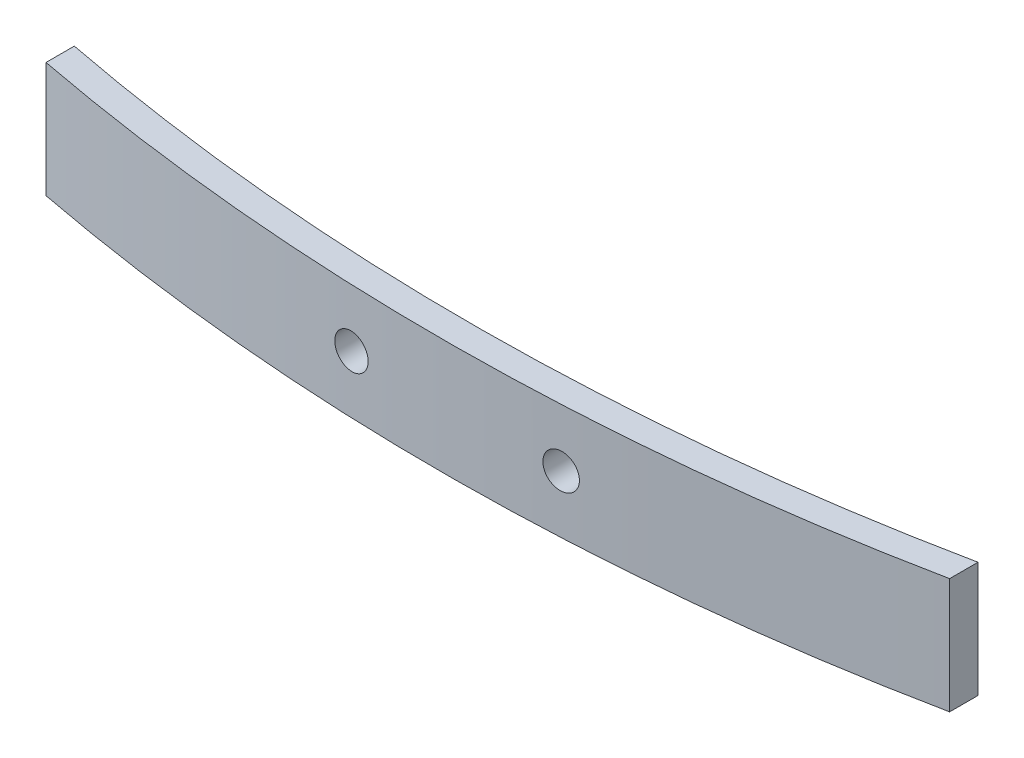
ISO-10303-21;
HEADER;
FILE_DESCRIPTION(('STEP AP214'),'2;1');
FILE_NAME('part.step','',(''),(''),'','','');
FILE_SCHEMA(('AUTOMOTIVE_DESIGN { 1 0 10303 214 1 1 1 1 }'));
ENDSEC;
DATA;
#1=APPLICATION_CONTEXT('core data for automotive mechanical design processes');
#2=APPLICATION_PROTOCOL_DEFINITION('international standard','automotive_design',2000,#1);
#3=PRODUCT_CONTEXT('',#1,'mechanical');
#4=PRODUCT('Part','Part','',(#3));
#5=PRODUCT_RELATED_PRODUCT_CATEGORY('part','',(#4));
#6=PRODUCT_DEFINITION_FORMATION('','',#4);
#7=PRODUCT_DEFINITION_CONTEXT('part definition',#1,'design');
#8=PRODUCT_DEFINITION('design','',#6,#7);
#9=PRODUCT_DEFINITION_SHAPE('','',#8);
#10=(LENGTH_UNIT() NAMED_UNIT(*) SI_UNIT(.MILLI.,.METRE.));
#11=(NAMED_UNIT(*) PLANE_ANGLE_UNIT() SI_UNIT($,.RADIAN.));
#12=(NAMED_UNIT(*) SI_UNIT($,.STERADIAN.) SOLID_ANGLE_UNIT());
#13=UNCERTAINTY_MEASURE_WITH_UNIT(LENGTH_MEASURE(1.E-05),#10,'distance_accuracy_value','');
#14=(GEOMETRIC_REPRESENTATION_CONTEXT(3) GLOBAL_UNCERTAINTY_ASSIGNED_CONTEXT((#13)) GLOBAL_UNIT_ASSIGNED_CONTEXT((#10,
#11,#12)) REPRESENTATION_CONTEXT('',''));
#15=CARTESIAN_POINT('',(0.,0.,0.));
#16=DIRECTION('',(0.,0.,1.));
#17=DIRECTION('',(1.,0.,0.));
#18=AXIS2_PLACEMENT_3D('',#15,#16,#17);
#19=CARTESIAN_POINT('',(-0.864955357142889,8.3,-164.510629845203));
#20=DIRECTION('',(0.,-1.,0.));
#21=DIRECTION('',(0.,0.,-1.));
#22=AXIS2_PLACEMENT_3D('',#19,#20,#21);
#23=CYLINDRICAL_SURFACE('',#22,165.210703971618);
#24=CARTESIAN_POINT('',(8.75496027693128,4.15,0.419761320254231));
#25=CARTESIAN_POINT('',(8.75495715259004,4.22012776188887,0.419761542884701));
#26=CARTESIAN_POINT('',(8.74903882101776,4.29030639664117,0.42010703230094));
#27=CARTESIAN_POINT('',(8.72551339839696,4.4287291306684,0.421476638973455));
#28=CARTESIAN_POINT('',(8.70789224050293,4.49697079864165,0.422501572922137));
#29=CARTESIAN_POINT('',(8.66146861973836,4.62949241544458,0.425189461827747));
#30=CARTESIAN_POINT('',(8.63267193494553,4.69377439168322,0.426852087074241));
#31=CARTESIAN_POINT('',(8.56472769460717,4.81657072161569,0.430750458858259));
#32=CARTESIAN_POINT('',(8.52558266973037,4.87508648063179,0.432986065270157));
#33=CARTESIAN_POINT('',(8.43801342814094,4.9847698821034,0.437948195991448));
#34=CARTESIAN_POINT('',(8.38958075080873,5.0359307496672,0.440675167774048));
#35=CARTESIAN_POINT('',(8.28483422347771,5.1293998710016,0.44651853933903));
#36=CARTESIAN_POINT('',(8.22852000329769,5.17170770872906,0.449634957412234));
#37=CARTESIAN_POINT('',(8.10951615566661,5.24633595250762,0.456152020027471));
#38=CARTESIAN_POINT('',(8.0468168572877,5.27864089983541,0.459553094283174));
#39=CARTESIAN_POINT('',(7.91689297455711,5.33226498600396,0.466520314337743));
#40=CARTESIAN_POINT('',(7.84966836586007,5.35358406573732,0.470086461024638));
#41=CARTESIAN_POINT('',(7.71251624830171,5.38465390754756,0.477273972274191));
#42=CARTESIAN_POINT('',(7.64258565741253,5.3943910522926,0.480895396774689));
#43=CARTESIAN_POINT('',(7.50207969231472,5.40197507469827,0.488080389340085));
#44=CARTESIAN_POINT('',(7.43150431760442,5.39982194310727,0.491643957359964));
#45=CARTESIAN_POINT('',(7.29169229198259,5.38368150567758,0.498614464223544));
#46=CARTESIAN_POINT('',(7.22245601084655,5.36969097748398,0.502021360151969));
#47=CARTESIAN_POINT('',(7.08731041847516,5.33026406415503,0.508589507906716));
#48=CARTESIAN_POINT('',(7.02140110324483,5.30482769276403,0.511750760028005));
#49=CARTESIAN_POINT('',(6.89482389528012,5.24324482251413,0.517751197591634));
#50=CARTESIAN_POINT('',(6.83415294085498,5.20710463525015,0.520590571471681));
#51=CARTESIAN_POINT('',(6.71973857092649,5.12513044677585,0.525888568664156));
#52=CARTESIAN_POINT('',(6.66599511710652,5.07929649918628,0.528347194082553));
#53=CARTESIAN_POINT('',(6.56702167323868,4.97928617455705,0.532833768859453));
#54=CARTESIAN_POINT('',(6.52178297040707,4.92511843978125,0.534862159253174));
#55=CARTESIAN_POINT('',(6.44104226200566,4.80994279406873,0.538456017950514));
#56=CARTESIAN_POINT('',(6.40554020414914,4.7489349198667,0.54002148874006));
#57=CARTESIAN_POINT('',(6.34531813797664,4.62187688825208,0.542663290949959));
#58=CARTESIAN_POINT('',(6.32058734079934,4.5558318545333,0.543740111864182));
#59=CARTESIAN_POINT('',(6.28256238689218,4.42052174403214,0.545391136221003));
#60=CARTESIAN_POINT('',(6.26926818249207,4.35125668067283,0.545965341758613));
#61=CARTESIAN_POINT('',(6.25450125084769,4.21152194868698,0.546602956663125));
#62=CARTESIAN_POINT('',(6.25302069467492,4.1410531088456,0.546666704311598));
#63=CARTESIAN_POINT('',(6.26190269709429,4.00086728732697,0.546283430440176));
#64=CARTESIAN_POINT('',(6.27226523401256,3.93115030427399,0.545836409855029));
#65=CARTESIAN_POINT('',(6.30453459144254,3.7944600012262,0.54443787079372));
#66=CARTESIAN_POINT('',(6.32643933451396,3.72748618983486,0.543486443103795));
#67=CARTESIAN_POINT('',(6.38116693951449,3.59816841100119,0.541092849093423));
#68=CARTESIAN_POINT('',(6.41398980811933,3.53582444638974,0.539650682472919));
#69=CARTESIAN_POINT('',(6.48963086187634,3.41751271541944,0.536297410542902));
#70=CARTESIAN_POINT('',(6.53245236046259,3.36154707193376,0.534386149770075));
#71=CARTESIAN_POINT('',(6.62686526857058,3.25759933104675,0.530127416616021));
#72=CARTESIAN_POINT('',(6.67845671174829,3.20961726428495,0.527779942560759));
#73=CARTESIAN_POINT('',(6.78898637350203,3.12295719408791,0.522690850990611));
#74=CARTESIAN_POINT('',(6.84793034066777,3.08428654090255,0.519948924812313));
#75=CARTESIAN_POINT('',(6.97145790954368,3.01738845265188,0.514129364496978));
#76=CARTESIAN_POINT('',(7.03604153672885,2.98916106476303,0.511051728843487));
#77=CARTESIAN_POINT('',(7.16908698444315,2.94391904019975,0.50462795534726));
#78=CARTESIAN_POINT('',(7.23755281675207,2.92691624080627,0.501281538208516));
#79=CARTESIAN_POINT('',(7.37635861492918,2.90464766013211,0.494407282898964));
#80=CARTESIAN_POINT('',(7.44669859549448,2.89938197092164,0.490879443305233));
#81=CARTESIAN_POINT('',(7.58732689699678,2.90073424051436,0.483735492092817));
#82=CARTESIAN_POINT('',(7.65761510543844,2.90736348948183,0.480119299827385));
#83=CARTESIAN_POINT('',(7.79607956813265,2.93233885968863,0.472908694526101));
#84=CARTESIAN_POINT('',(7.86425581074991,2.95068504546716,0.469314281610324));
#85=CARTESIAN_POINT('',(7.99658775089416,2.99858527301703,0.462259310556309));
#86=CARTESIAN_POINT('',(8.0607418890637,3.02814363078217,0.458798804529963));
#87=CARTESIAN_POINT('',(8.18317480890034,3.09763156107121,0.452129015386681));
#88=CARTESIAN_POINT('',(8.24145382984545,3.13756071098308,0.448919722039708));
#89=CARTESIAN_POINT('',(8.35044266706128,3.22663141697335,0.442867022064361));
#90=CARTESIAN_POINT('',(8.40115749080369,3.27576682948656,0.44002337355392));
#91=CARTESIAN_POINT('',(8.4936283502276,3.38189250881125,0.434802856160991));
#92=CARTESIAN_POINT('',(8.53538221583379,3.43888467281662,0.432426100357688));
#93=CARTESIAN_POINT('',(8.6086851855516,3.55903344302298,0.428232139382776));
#94=CARTESIAN_POINT('',(8.64024332695314,3.62218452507149,0.426414438744662));
#95=CARTESIAN_POINT('',(8.69227167185321,3.75285327847664,0.423407891004748));
#96=CARTESIAN_POINT('',(8.71275530328993,3.82036555010171,0.422218282377225));
#97=CARTESIAN_POINT('',(8.7365727105935,3.93192651802067,0.420833020846883));
#98=CARTESIAN_POINT('',(8.74345935750805,3.97524632551218,0.420431798844835));
#99=CARTESIAN_POINT('',(8.75265411467353,4.0623707998554,0.419895879115414));
#100=CARTESIAN_POINT('',(8.75496222940765,4.1061754662323,0.419761181127067));
#101=CARTESIAN_POINT('',(8.75496027693128,4.15,0.419761320254231));
#102=B_SPLINE_CURVE_WITH_KNOTS('',3,(#24,#25,#26,#27,#28,#29,#30,#31,#32,#33,#34,#35,#36,#37,
#38,#39,#40,#41,#42,#43,#44,#45,#46,#47,#48,#49,#50,#51,#52,#53,#54,#55,#56,#57,#58,#59,#60,#61,
#62,#63,#64,#65,#66,#67,#68,#69,#70,#71,#72,#73,#74,#75,#76,#77,#78,#79,#80,#81,#82,#83,#84,#85,
#86,#87,#88,#89,#90,#91,#92,#93,#94,#95,#96,#97,#98,#99,#100,#101),.UNSPECIFIED.,.T.,.F.,(4,2,2,
2,2,2,2,2,2,2,2,2,2,2,2,2,2,2,2,2,2,2,2,2,2,2,2,2,2,2,2,2,2,2,2,2,2,2,4),(0.,0.210223177189666,
0.420699501951169,0.631067148901838,0.841383398320761,1.05189215408555,1.26241080036969,
1.47325318222957,1.6840966984751,1.89518786738256,2.10627920053656,2.31742801508991,
2.52857657609271,2.73960087861519,2.95062401389348,3.16142977192405,3.37223439788553,
3.58282738642935,3.79341949717081,4.00387203649564,4.21432419067519,4.42473847925807,
4.63515289649597,4.84563714192886,5.05612219514426,5.26677286045359,5.47742447734574,
5.6882978908643,5.8991729585455,6.11024828566987,6.3213247754489,6.53248259923149,
6.7436318196366,6.95464063361698,7.16570049008606,7.37657275067938,7.58718875014188,
7.718562424425,7.84993597007017),.UNSPECIFIED.);
#103=CARTESIAN_POINT('',(8.75496027693128,4.15,0.419761320254231));
#104=VERTEX_POINT('',#103);
#105=EDGE_CURVE('E112',#104,#104,#102,.T.);
#106=ORIENTED_EDGE('',*,*,#105,.T.);
#107=EDGE_LOOP('',(#106));
#108=FACE_BOUND('',#107,.T.);
#109=CARTESIAN_POINT('',(-6.24503972306872,4.15,0.612449701579171));
#110=CARTESIAN_POINT('',(-6.24504283877439,4.22018360507798,0.612449640448258));
#111=CARTESIAN_POINT('',(-6.2509704916655,4.29041808412336,0.612256794117345));
#112=CARTESIAN_POINT('',(-6.27453424552286,4.42895230581188,0.61148647073164));
#113=CARTESIAN_POINT('',(-6.2921844319995,4.49724961773537,0.610908530955234));
#114=CARTESIAN_POINT('',(-6.33868895925644,4.62988204890237,0.609373441567636));
#115=CARTESIAN_POINT('',(-6.36753784796296,4.69421907857243,0.60841647647983));
#116=CARTESIAN_POINT('',(-6.43561123976186,4.81711721137688,0.606133852436909));
#117=CARTESIAN_POINT('',(-6.47483317008242,4.87567974179275,0.604808284900166));
#118=CARTESIAN_POINT('',(-6.5625536422637,4.98540689200779,0.601804578598962));
#119=CARTESIAN_POINT('',(-6.611055011315,5.03656924881329,0.600126332367601));
#120=CARTESIAN_POINT('',(-6.71594967952864,5.13002721489337,0.596442445789051));
#121=CARTESIAN_POINT('',(-6.77234330523671,5.17232245710605,0.594436791894649));
#122=CARTESIAN_POINT('',(-6.89144872175326,5.24686646391694,0.59013221246902));
#123=CARTESIAN_POINT('',(-6.9541636281333,5.27911024208824,0.5878331421715));
#124=CARTESIAN_POINT('',(-7.08410720631077,5.33261213888801,0.582989292877448));
#125=CARTESIAN_POINT('',(-7.15133588543513,5.3538702396836,0.580444513482067));
#126=CARTESIAN_POINT('',(-7.28844540689511,5.38481217998928,0.575166604891806));
#127=CARTESIAN_POINT('',(-7.35832796307873,5.39448840424185,0.572433353020987));
#128=CARTESIAN_POINT('',(-7.49872098348199,5.40196966393845,0.566851342210558));
#129=CARTESIAN_POINT('',(-7.56923144889067,5.39977467689789,0.564002583052183));
#130=CARTESIAN_POINT('',(-7.70892020746554,5.38357274204756,0.558270140200238));
#131=CARTESIAN_POINT('',(-7.77809774336756,5.36955927118439,0.555386438086882));
#132=CARTESIAN_POINT('',(-7.91311781585716,5.33010907067557,0.549676351579997));
#133=CARTESIAN_POINT('',(-7.97896034307322,5.30467230893204,0.546849967347547));
#134=CARTESIAN_POINT('',(-8.10544890364487,5.24309153267341,0.541349763017055));
#135=CARTESIAN_POINT('',(-8.1660943101938,5.20694622897485,0.538675961334419));
#136=CARTESIAN_POINT('',(-8.28045560269151,5.12497251435407,0.533577398562491));
#137=CARTESIAN_POINT('',(-8.33417150490061,5.0791441261542,0.53115263688882));
#138=CARTESIAN_POINT('',(-8.43311865371031,4.97912834555304,0.52664494025073));
#139=CARTESIAN_POINT('',(-8.47835422530451,4.92494523992106,0.52456183111072));
#140=CARTESIAN_POINT('',(-8.55908455655416,4.80973930743974,0.520817828259599));
#141=CARTESIAN_POINT('',(-8.59457936685342,4.74871651615337,0.519156932353336));
#142=CARTESIAN_POINT('',(-8.65478398333838,4.62162746856163,0.516326100462941));
#143=CARTESIAN_POINT('',(-8.67950435821031,4.55556622958673,0.515155683409783));
#144=CARTESIAN_POINT('',(-8.7175040630106,4.4202243510701,0.513351898694548));
#145=CARTESIAN_POINT('',(-8.73078346025493,4.35094373047297,0.512718527872618));
#146=CARTESIAN_POINT('',(-8.74551430103045,4.21119839428657,0.512015731282366));
#147=CARTESIAN_POINT('',(-8.74697666898013,4.14073483269903,0.511945784648838));
#148=CARTESIAN_POINT('',(-8.73806040240198,4.00056277842912,0.512371408910377));
#149=CARTESIAN_POINT('',(-8.72768179925441,3.93085428374621,0.512866978306745));
#150=CARTESIAN_POINT('',(-8.69538512842358,3.79419187891503,0.51440260426172));
#151=CARTESIAN_POINT('',(-8.67347043688291,3.72723716902388,0.515442501517261));
#152=CARTESIAN_POINT('',(-8.61872902277598,3.59795852069422,0.518023567611638));
#153=CARTESIAN_POINT('',(-8.58590227867445,3.53563459139498,0.51956473743975));
#154=CARTESIAN_POINT('',(-8.51025151058069,3.41734986948092,0.523086657485392));
#155=CARTESIAN_POINT('',(-8.46742220765421,3.36139246012191,0.525067639790299));
#156=CARTESIAN_POINT('',(-8.37299376296533,3.25746068544556,0.529390434822085));
#157=CARTESIAN_POINT('',(-8.32139457053689,3.2094863662519,0.531732249633585));
#158=CARTESIAN_POINT('',(-8.21083440462293,3.12283102847463,0.53669011816241));
#159=CARTESIAN_POINT('',(-8.15186605470748,3.08415943686989,0.539306446236985));
#160=CARTESIAN_POINT('',(-8.02828172033344,3.01726434827163,0.544716275013323));
#161=CARTESIAN_POINT('',(-7.96366571211947,2.98904089522806,0.547509776460306));
#162=CARTESIAN_POINT('',(-7.83055792972229,2.94381903365589,0.553180619859146));
#163=CARTESIAN_POINT('',(-7.76206278674184,2.92683054948449,0.55605803359858));
#164=CARTESIAN_POINT('',(-7.62319148762382,2.90459965098885,0.561802071644821));
#165=CARTESIAN_POINT('',(-7.5528153234997,2.89935728654505,0.564668695905759));
#166=CARTESIAN_POINT('',(-7.41215603053966,2.90076879979632,0.570307352243302));
#167=CARTESIAN_POINT('',(-7.34187293828336,2.90742645045739,0.573079354035342));
#168=CARTESIAN_POINT('',(-7.20341837634375,2.93245901601626,0.578453364712801));
#169=CARTESIAN_POINT('',(-7.13524690890161,2.95083394334973,0.581055373417801));
#170=CARTESIAN_POINT('',(-7.00297137414322,2.99877618278969,0.586026236209309));
#171=CARTESIAN_POINT('',(-6.93886624220364,3.02834055110486,0.588395151413221));
#172=CARTESIAN_POINT('',(-6.81653024260381,3.09782459200736,0.59285047753035));
#173=CARTESIAN_POINT('',(-6.75829912700231,3.13774382726325,0.594936900368796));
#174=CARTESIAN_POINT('',(-6.64940632986686,3.22677365919108,0.598787831696479));
#175=CARTESIAN_POINT('',(-6.59873922526678,3.27587761335997,0.600552571021358));
#176=CARTESIAN_POINT('',(-6.50635532558204,3.38191900568697,0.603734933028591));
#177=CARTESIAN_POINT('',(-6.46464072829734,3.43885836178299,0.605152470486499));
#178=CARTESIAN_POINT('',(-6.39137389484262,3.55892532336698,0.607620971669095));
#179=CARTESIAN_POINT('',(-6.35982009157116,3.62205197262659,0.608671991923887));
#180=CARTESIAN_POINT('',(-6.3077939874283,3.75266178054924,0.610395159078546));
#181=CARTESIAN_POINT('',(-6.28730836815957,3.82013959344892,0.611067761370984));
#182=CARTESIAN_POINT('',(-6.26346456763099,3.93170688176151,0.611848584729489));
#183=CARTESIAN_POINT('',(-6.25656390265825,3.97507040496065,0.612073880533101));
#184=CARTESIAN_POINT('',(-6.24735050720567,4.06228266014171,0.612374458044323));
#185=CARTESIAN_POINT('',(-6.24503777558155,4.10613139200262,0.612449739789349));
#186=CARTESIAN_POINT('',(-6.24503972306872,4.15,0.612449701579171));
#187=B_SPLINE_CURVE_WITH_KNOTS('',3,(#109,#110,#111,#112,#113,#114,#115,#116,#117,#118,#119,
#120,#121,#122,#123,#124,#125,#126,#127,#128,#129,#130,#131,#132,#133,#134,#135,#136,#137,#138,
#139,#140,#141,#142,#143,#144,#145,#146,#147,#148,#149,#150,#151,#152,#153,#154,#155,#156,#157,
#158,#159,#160,#161,#162,#163,#164,#165,#166,#167,#168,#169,#170,#171,#172,#173,#174,#175,#176,
#177,#178,#179,#180,#181,#182,#183,#184,#185,#186),.UNSPECIFIED.,.T.,.F.,(4,2,2,2,2,2,2,2,2,2,2,
2,2,2,2,2,2,2,2,2,2,2,2,2,2,2,2,2,2,2,2,2,2,2,2,2,2,2,4),(0.,0.210390661059293,
0.421034580871365,0.631576077319847,0.842065403143359,1.05261896171306,1.26318123460973,
1.47384779963844,1.68451470663738,1.89532005432909,2.10612580129541,2.31704797586549,
2.52797074310193,2.73891891330345,2.9498665884991,3.16070638532802,3.37154508594557,
3.58217650604036,3.7928066868217,4.00324212527539,4.21367700604665,4.42405033532167,
4.63442407977717,4.84490910264051,5.0553953415746,5.26609398795101,5.47679352061828,
5.68767892600816,5.89856522693079,6.10951840238898,6.32047180173413,6.53136974061397,
6.74225877379887,6.95299587501928,7.16378465221264,7.37454090381962,7.58504298341746,
7.716548735053,7.84805445388952),.UNSPECIFIED.);
#188=CARTESIAN_POINT('',(-6.24503972306872,4.15,0.612449701579171));
#189=VERTEX_POINT('',#188);
#190=EDGE_CURVE('E123',#189,#189,#187,.T.);
#191=ORIENTED_EDGE('',*,*,#190,.T.);
#192=EDGE_LOOP('',(#191));
#193=FACE_BOUND('',#192,.T.);
#194=CARTESIAN_POINT('',(-0.864955357142889,0.,-164.510629845203));
#195=DIRECTION('',(0.,-1.,0.));
#196=DIRECTION('',(0.,0.,1.));
#197=AXIS2_PLACEMENT_3D('',#194,#195,#196);
#198=CIRCLE('',#197,165.210703971618);
#199=CARTESIAN_POINT('',(32.3290587197964,0.,-2.66893516717083));
#200=VERTEX_POINT('',#199);
#201=CARTESIAN_POINT('',(-32.3092176120712,0.,-2.31989312438794));
#202=VERTEX_POINT('',#201);
#203=EDGE_CURVE('E109',#200,#202,#198,.T.);
#204=ORIENTED_EDGE('',*,*,#203,.T.);
#205=DIRECTION('',(0.,-1.,0.));
#206=VECTOR('',#205,1.);
#207=CARTESIAN_POINT('',(-32.3092176120712,8.3,-2.31989312438794));
#208=LINE('',#207,#206);
#209=CARTESIAN_POINT('',(-32.3092176120712,8.3,-2.31989312438794));
#210=VERTEX_POINT('',#209);
#211=EDGE_CURVE('E11',#210,#202,#208,.T.);
#212=ORIENTED_EDGE('',*,*,#211,.F.);
#213=CARTESIAN_POINT('',(-0.864955357142889,8.3,-164.510629845203));
#214=DIRECTION('',(0.,-1.,0.));
#215=DIRECTION('',(0.,0.,1.));
#216=AXIS2_PLACEMENT_3D('',#213,#214,#215);
#217=CIRCLE('',#216,165.210703971618);
#218=CARTESIAN_POINT('',(32.3290587197964,8.3,-2.66893516717083));
#219=VERTEX_POINT('',#218);
#220=EDGE_CURVE('E96',#219,#210,#217,.T.);
#221=ORIENTED_EDGE('',*,*,#220,.F.);
#222=DIRECTION('',(0.,-1.,0.));
#223=VECTOR('',#222,1.);
#224=CARTESIAN_POINT('',(32.3290587197964,8.3,-2.66893516717083));
#225=LINE('',#224,#223);
#226=EDGE_CURVE('E105',#219,#200,#225,.T.);
#227=ORIENTED_EDGE('',*,*,#226,.T.);
#228=EDGE_LOOP('',(#204,#212,#221,#227));
#229=FACE_BOUND('',#228,.T.);
#230=ADVANCED_FACE('F37',(#108,#193,#229),#23,.F.);
#231=CARTESIAN_POINT('',(-32.3092176120712,8.3,-2.31989312438794));
#232=DIRECTION('',(1.,0.,0.));
#233=DIRECTION('',(0.,0.,-1.));
#234=AXIS2_PLACEMENT_3D('',#231,#232,#233);
#235=PLANE('',#234);
#236=DIRECTION('',(0.,0.,1.));
#237=VECTOR('',#236,1.);
#238=CARTESIAN_POINT('',(-32.3092176120712,0.,-2.31989312438794));
#239=LINE('',#238,#237);
#240=CARTESIAN_POINT('',(-32.3092176120713,0.,-0.283111158695365));
#241=VERTEX_POINT('',#240);
#242=EDGE_CURVE('E100',#202,#241,#239,.T.);
#243=ORIENTED_EDGE('',*,*,#242,.T.);
#244=DIRECTION('',(0.,-1.,0.));
#245=VECTOR('',#244,1.);
#246=CARTESIAN_POINT('',(-32.3092176120713,8.3,-0.283111158695365));
#247=LINE('',#246,#245);
#248=CARTESIAN_POINT('',(-32.3092176120713,8.3,-0.283111158695365));
#249=VERTEX_POINT('',#248);
#250=EDGE_CURVE('E52',#249,#241,#247,.T.);
#251=ORIENTED_EDGE('',*,*,#250,.F.);
#252=DIRECTION('',(0.,0.,1.));
#253=VECTOR('',#252,1.);
#254=CARTESIAN_POINT('',(-32.3092176120712,8.3,-2.31989312438794));
#255=LINE('',#254,#253);
#256=EDGE_CURVE('E91',#210,#249,#255,.T.);
#257=ORIENTED_EDGE('',*,*,#256,.F.);
#258=ORIENTED_EDGE('',*,*,#211,.T.);
#259=EDGE_LOOP('',(#243,#251,#257,#258));
#260=FACE_BOUND('',#259,.T.);
#261=ADVANCED_FACE('F99',(#260),#235,.F.);
#262=CARTESIAN_POINT('',(-0.864955357142889,8.3,-164.510629845203));
#263=DIRECTION('',(0.,-1.,0.));
#264=DIRECTION('',(0.,0.,-1.));
#265=AXIS2_PLACEMENT_3D('',#262,#263,#264);
#266=CYLINDRICAL_SURFACE('',#265,167.210703971618);
#267=CARTESIAN_POINT('',(8.75496027693128,4.15,2.42311972592843));
#268=CARTESIAN_POINT('',(8.7549571528464,4.0798702088655,2.42311994587401));
#269=CARTESIAN_POINT('',(8.74903848237771,4.00968954399093,2.42346130863886));
#270=CARTESIAN_POINT('',(8.72551166864732,3.8712627632816,2.42481455884801));
#271=CARTESIAN_POINT('',(8.70788945763707,3.80301907877586,2.42582725323555));
#272=CARTESIAN_POINT('',(8.66146290914616,3.67049345987212,2.42848305287518));
#273=CARTESIAN_POINT('',(8.63266433975993,3.6062095016657,2.43012583293631));
#274=CARTESIAN_POINT('',(8.5647154284122,3.48340948989038,2.43397768644527));
#275=CARTESIAN_POINT('',(8.52556761836319,3.42489203036412,2.43618662138089));
#276=CARTESIAN_POINT('',(8.43799273186777,3.31520683510581,2.44108951951476));
#277=CARTESIAN_POINT('',(8.38955737216025,3.26404573208298,2.44378391554936));
#278=CARTESIAN_POINT('',(8.28480494382434,3.17057665988944,2.4495574898447));
#279=CARTESIAN_POINT('',(8.22848750642859,3.12826910516807,2.45263668610781));
#280=CARTESIAN_POINT('',(8.10947904666495,3.05364358907666,2.45907579272007));
#281=CARTESIAN_POINT('',(8.04677858600776,3.02134071483143,2.46243611741457));
#282=CARTESIAN_POINT('',(7.91685254726984,2.96772091932823,2.469319851007));
#283=CARTESIAN_POINT('',(7.8496269456401,2.94640405524691,2.47284326075362));
#284=CARTESIAN_POINT('',(7.71247508035552,2.91533926667632,2.47994452278065));
#285=CARTESIAN_POINT('',(7.64254580844858,2.9056046354044,2.48352243285368));
#286=CARTESIAN_POINT('',(7.50204294969634,2.89802510464708,2.49062107608184));
#287=CARTESIAN_POINT('',(7.43146936238961,2.90018021367689,2.49414180919603));
#288=CARTESIAN_POINT('',(7.29166180538937,2.91632389376349,2.50102849084591));
#289=CARTESIAN_POINT('',(7.22242819670582,2.93031560960369,2.5043943979964));
#290=CARTESIAN_POINT('',(7.08728821765012,2.96974394050637,2.51088351236731));
#291=CARTESIAN_POINT('',(7.02138184346096,2.99518054243892,2.51400671986617));
#292=CARTESIAN_POINT('',(6.89480967024032,3.05676323309922,2.51993497986177));
#293=CARTESIAN_POINT('',(6.83414088213581,3.09290316059229,2.52274021411475));
#294=CARTESIAN_POINT('',(6.71973079534213,3.1748759681489,2.5279745059938));
#295=CARTESIAN_POINT('',(6.66598945918457,3.22070879578306,2.5304035656545));
#296=CARTESIAN_POINT('',(6.56701870175015,3.32071724989849,2.53483624587924));
#297=CARTESIAN_POINT('',(6.52178077537898,3.37488444065654,2.53684029180138));
#298=CARTESIAN_POINT('',(6.44104150253602,3.49005854005354,2.54039101701982));
#299=CARTESIAN_POINT('',(6.40554010505716,3.55106541285887,2.54193769871214));
#300=CARTESIAN_POINT('',(6.34531832849511,3.67812258625027,2.54454783031626));
#301=CARTESIAN_POINT('',(6.32058741768736,3.74416788548266,2.5456117523287));
#302=CARTESIAN_POINT('',(6.28256233948997,3.87947841102811,2.54724299762261));
#303=CARTESIAN_POINT('',(6.26926812555421,3.94874362423525,2.54781032292518));
#304=CARTESIAN_POINT('',(6.25450110051763,4.08847970756632,2.54844030136632));
#305=CARTESIAN_POINT('',(6.25302064684505,4.15894976866929,2.54850328077702));
#306=CARTESIAN_POINT('',(6.26190326247084,4.29913800347308,2.54812457345232));
#307=CARTESIAN_POINT('',(6.27226631062292,4.36885617851615,2.54768288761797));
#308=CARTESIAN_POINT('',(6.30453719521118,4.50554910587772,2.54630104153986));
#309=CARTESIAN_POINT('',(6.32644300362672,4.57252433789419,2.54536096886065));
#310=CARTESIAN_POINT('',(6.38117331705684,4.70184480051592,2.54299593962249));
#311=CARTESIAN_POINT('',(6.4139978285545,4.76419002837205,2.54157098277563));
#312=CARTESIAN_POINT('',(6.48964248692514,4.8825035365914,2.53825773419188));
#313=CARTESIAN_POINT('',(6.53246586861391,4.93846974448754,2.5363692924991));
#314=CARTESIAN_POINT('',(6.62688304206684,5.04241829266776,2.53216140069847));
#315=CARTESIAN_POINT('',(6.6784768667747,5.09040060296125,2.52984194897164));
#316=CARTESIAN_POINT('',(6.78901074100218,5.1770598438358,2.52481364780539));
#317=CARTESIAN_POINT('',(6.84795640280315,5.21572959853617,2.52210450063349));
#318=CARTESIAN_POINT('',(6.97148756497417,5.28262558158907,2.51635451163316));
#319=CARTESIAN_POINT('',(7.0360730900755,5.31085176414284,2.51331366835021));
#320=CARTESIAN_POINT('',(7.16912077651875,5.3560903483621,2.50696677170296));
#321=CARTESIAN_POINT('',(7.23758685423461,5.37309119410333,2.50366044895461));
#322=CARTESIAN_POINT('',(7.37639302067456,5.39535588427433,2.49686856781983));
#323=CARTESIAN_POINT('',(7.44673312382604,5.4006196383184,2.49338300805334));
#324=CARTESIAN_POINT('',(7.58735984781747,5.39926349863077,2.48632477193319));
#325=CARTESIAN_POINT('',(7.65764635863717,5.39263258443704,2.48275201781908));
#326=CARTESIAN_POINT('',(7.79610720702339,5.36765444305359,2.47562804942547));
#327=CARTESIAN_POINT('',(7.86428153313055,5.3493071523099,2.47207683526292));
#328=CARTESIAN_POINT('',(7.99660885847372,5.30140557704528,2.46510670820443));
#329=CARTESIAN_POINT('',(8.06076033392585,5.27184707544336,2.46168784562632));
#330=CARTESIAN_POINT('',(8.18318793797181,5.20235981239838,2.45509834056858));
#331=CARTESIAN_POINT('',(8.24146430563974,5.16243147316881,2.45192768798979));
#332=CARTESIAN_POINT('',(8.3504487904433,5.07336283359917,2.44594783699009));
#333=CARTESIAN_POINT('',(8.40116181503466,5.02422855362451,2.44313840435718));
#334=CARTESIAN_POINT('',(8.49362935558444,4.91810599144934,2.43798070844005));
#335=CARTESIAN_POINT('',(8.5353817001071,4.86111581101609,2.43563255694943));
#336=CARTESIAN_POINT('',(8.60868340492228,4.74096983687513,2.43148899329326));
#337=CARTESIAN_POINT('',(8.64024147144944,4.67781936459119,2.42969310953696));
#338=CARTESIAN_POINT('',(8.69226980636794,4.54715217525954,2.42672264206104));
#339=CARTESIAN_POINT('',(8.71275349928099,4.47964085619112,2.42554730614472));
#340=CARTESIAN_POINT('',(8.7365716570367,4.36807969416139,2.42417862581894));
#341=CARTESIAN_POINT('',(8.74345870055725,4.32475864584428,2.42378219600759));
#342=CARTESIAN_POINT('',(8.75265398447362,4.23763168727944,2.42325267746358));
#343=CARTESIAN_POINT('',(8.75496222924636,4.19382577749524,2.4231195884792));
#344=CARTESIAN_POINT('',(8.75496027693128,4.15,2.42311972592843));
#345=B_SPLINE_CURVE_WITH_KNOTS('',3,(#267,#268,#269,#270,#271,#272,#273,#274,#275,#276,#277,
#278,#279,#280,#281,#282,#283,#284,#285,#286,#287,#288,#289,#290,#291,#292,#293,#294,#295,#296,
#297,#298,#299,#300,#301,#302,#303,#304,#305,#306,#307,#308,#309,#310,#311,#312,#313,#314,#315,
#316,#317,#318,#319,#320,#321,#322,#323,#324,#325,#326,#327,#328,#329,#330,#331,#332,#333,#334,
#335,#336,#337,#338,#339,#340,#341,#342,#343,#344),.UNSPECIFIED.,.T.,.F.,(4,2,2,2,2,2,2,2,2,2,2,
2,2,2,2,2,2,2,2,2,2,2,2,2,2,2,2,2,2,2,2,2,2,2,2,2,2,2,4),(0.,0.210229263942492,
0.420711683588777,0.631085617864892,0.841408132304967,1.05191910638154,1.26243993262468,
1.47327669706947,1.68411455880228,1.89519417169368,2.10627393575638,2.31740979771044,
2.52854541744324,2.73955973506051,2.95057291132037,3.16137389630491,3.37217377693843,
3.58276706538264,3.79335949673073,4.00381568032061,4.21427148814669,4.42469033198233,
4.63510930075602,4.84559643843402,5.05608436676486,5.26673397334308,5.47738450368346,
5.68825155153217,5.89912022323278,6.11018436659725,6.32124965486134,6.53239441389428,
6.74353057740279,6.9545291441053,7.165578784363,7.37644770210302,7.58706042495142,
7.71843782680456,7.8498151030731),.UNSPECIFIED.);
#346=CARTESIAN_POINT('',(8.75496027693128,4.15,2.42311972592843));
#347=VERTEX_POINT('',#346);
#348=EDGE_CURVE('E41',#347,#347,#345,.T.);
#349=ORIENTED_EDGE('',*,*,#348,.T.);
#350=EDGE_LOOP('',(#349));
#351=FACE_BOUND('',#350,.T.);
#352=CARTESIAN_POINT('',(-6.24503972306872,4.15,2.61349831976138));
#353=CARTESIAN_POINT('',(-6.24504283872313,4.07981569462833,2.61349825936488));
#354=CARTESIAN_POINT('',(-6.2509706088578,4.00958051441819,2.6133077182952));
#355=CARTESIAN_POINT('',(-6.27453484239815,3.87104489920316,2.61254660284087));
#356=CARTESIAN_POINT('',(-6.29218539178212,3.80274689496064,2.61197557125982));
#357=CARTESIAN_POINT('',(-6.33869092329322,3.67011309891619,2.61045882950026));
#358=CARTESIAN_POINT('',(-6.36754045560192,3.60577539750827,2.60951330156031));
#359=CARTESIAN_POINT('',(-6.43561544864962,3.48287600615774,2.60725795559372));
#360=CARTESIAN_POINT('',(-6.47483833636756,3.42431288881791,2.60594822789956));
#361=CARTESIAN_POINT('',(-6.56256085739203,3.31458499016129,2.60298041754632));
#362=CARTESIAN_POINT('',(-6.61106327382716,3.26342243653615,2.60132223036208));
#363=CARTESIAN_POINT('',(-6.71596031674554,3.16996426090503,2.5976823716216));
#364=CARTESIAN_POINT('',(-6.77235526938815,3.12766900552103,2.59570068669623));
#365=CARTESIAN_POINT('',(-6.89146287591005,3.05312572763626,2.59144757242761));
#366=CARTESIAN_POINT('',(-6.95417856859592,3.02088256864264,2.58917600357652));
#367=CARTESIAN_POINT('',(-7.08412382388626,2.9673820571989,2.58439009635308));
#368=CARTESIAN_POINT('',(-7.1513533934286,2.94612472163454,2.58187575760758));
#369=CARTESIAN_POINT('',(-7.28846366775413,2.91518478760806,2.5766610259615));
#370=CARTESIAN_POINT('',(-7.35834604574863,2.90550962387708,2.57396051472942));
#371=CARTESIAN_POINT('',(-7.4987386436376,2.89803040354637,2.56844537531512));
#372=CARTESIAN_POINT('',(-7.56924886466585,2.90022636838801,2.56563074692677));
#373=CARTESIAN_POINT('',(-7.70893609029652,2.91643007559756,2.55996703081402));
#374=CARTESIAN_POINT('',(-7.77811235559631,2.93044418567131,2.55711792532895));
#375=CARTESIAN_POINT('',(-7.91312981060176,2.96989524666556,2.55147635548112));
#376=CARTESIAN_POINT('',(-7.97897099107595,2.99533222920255,2.54868389127515));
#377=CARTESIAN_POINT('',(-8.10545663489397,3.05691287727325,2.54324971509525));
#378=CARTESIAN_POINT('',(-8.16610048654807,3.09305780083276,2.54060802087809));
#379=CARTESIAN_POINT('',(-8.2804587657324,3.17503015030839,2.53557069037046));
#380=CARTESIAN_POINT('',(-8.33417320920355,3.22085755394959,2.53317505351395));
#381=CARTESIAN_POINT('',(-8.43311829996461,3.3208713394655,2.52872147554591));
#382=CARTESIAN_POINT('',(-8.47835316938386,3.37505353671532,2.52666336643759));
#383=CARTESIAN_POINT('',(-8.55908231130434,3.49025720501676,2.52296429532718));
#384=CARTESIAN_POINT('',(-8.59457663320809,3.55127864137861,2.52132333120941));
#385=CARTESIAN_POINT('',(-8.6547813734493,3.67836609494175,2.51852642763923));
#386=CARTESIAN_POINT('',(-8.67950210863605,3.74442721454667,2.51737002420976));
#387=CARTESIAN_POINT('',(-8.71750253581197,3.87976875340082,2.51558782877393));
#388=CARTESIAN_POINT('',(-8.73078229352287,3.94904915415473,2.51496203371954));
#389=CARTESIAN_POINT('',(-8.74551408324217,4.08879559067025,2.51426761738414));
#390=CARTESIAN_POINT('',(-8.74697677959568,4.15926049989598,2.51419849373341));
#391=CARTESIAN_POINT('',(-8.73806071112983,4.29943529634759,2.51461900639458));
#392=CARTESIAN_POINT('',(-8.72768197693446,4.36914518552561,2.51510864126144));
#393=CARTESIAN_POINT('',(-8.69538442454135,4.50581087848095,2.5166259002582));
#394=CARTESIAN_POINT('',(-8.67346890233094,4.57276746297275,2.5176533707314));
#395=CARTESIAN_POINT('',(-8.61872510447767,4.70204972478396,2.52020360755254));
#396=CARTESIAN_POINT('',(-8.58589680784414,4.76437539319554,2.52172637485317));
#397=CARTESIAN_POINT('',(-8.51024266293216,4.88266253274928,2.52520623166346));
#398=CARTESIAN_POINT('',(-8.46741166106498,4.93862070105299,2.52716354503397));
#399=CARTESIAN_POINT('',(-8.3729793177215,5.04255365996574,2.53143469813236));
#400=CARTESIAN_POINT('',(-8.3213779266934,5.09052840546622,2.53374853987458));
#401=CARTESIAN_POINT('',(-8.21081427156215,5.17718302268616,2.53864713239836));
#402=CARTESIAN_POINT('',(-8.15184480616942,5.21585369125159,2.5412321478132));
#403=CARTESIAN_POINT('',(-8.02825822726557,5.28274674122266,2.54657722857067));
#404=CARTESIAN_POINT('',(-7.96364109070505,5.31096907998386,2.5493372946277));
#405=CARTESIAN_POINT('',(-7.83053255367844,5.35618797520659,2.55494019966832));
#406=CARTESIAN_POINT('',(-7.76203786478443,5.37317484358379,2.55778310788552));
#407=CARTESIAN_POINT('',(-7.62316776116823,5.39540274321085,2.56345825718829));
#408=CARTESIAN_POINT('',(-7.5527923385704,5.40064372526658,2.56629049822913));
#409=CARTESIAN_POINT('',(-7.41213536779606,5.39922974962037,2.5718614938066));
#410=CARTESIAN_POINT('',(-7.34185385541437,5.3925711096751,2.57460021913827));
#411=CARTESIAN_POINT('',(-7.20340268095928,5.36753713569729,2.57990971206706));
#412=CARTESIAN_POINT('',(-7.13523302117485,5.34916178896587,2.58248047948215));
#413=CARTESIAN_POINT('',(-7.00296076302201,5.30121920553159,2.58739167234222));
#414=CARTESIAN_POINT('',(-6.93885712706637,5.27165483762113,2.58973215663665));
#415=CARTESIAN_POINT('',(-6.81652413566854,5.20217137344572,2.59413400955821));
#416=CARTESIAN_POINT('',(-6.75829453269952,5.16225271375533,2.5961953899478));
#417=CARTESIAN_POINT('',(-6.64940379765269,5.07322397338548,2.60000012975777));
#418=CARTESIAN_POINT('',(-6.59873735289013,5.02412039973018,2.60174371260479));
#419=CARTESIAN_POINT('',(-6.50635469616956,4.91808010956776,2.60488792316268));
#420=CARTESIAN_POINT('',(-6.46464068270567,4.86114147458602,2.60628846664351));
#421=CARTESIAN_POINT('',(-6.39137425213848,4.74107535110087,2.60872739605041));
#422=CARTESIAN_POINT('',(-6.35982042068637,4.67794872559437,2.6097658323853));
#423=CARTESIAN_POINT('',(-6.30779427495479,4.54733906899493,2.6114683680618));
#424=CARTESIAN_POINT('',(-6.28730864306548,4.4798613832102,2.61213291731623));
#425=CARTESIAN_POINT('',(-6.26346472639894,4.36829405497203,2.61290439523635));
#426=CARTESIAN_POINT('',(-6.25656400127927,4.3249303408158,2.61312699540947));
#427=CARTESIAN_POINT('',(-6.24735052645073,4.23771770977689,2.6134239765294));
#428=CARTESIAN_POINT('',(-6.24503777562481,4.19386879301234,2.61349835751229));
#429=CARTESIAN_POINT('',(-6.24503972306872,4.15,2.61349831976138));
#430=B_SPLINE_CURVE_WITH_KNOTS('',3,(#352,#353,#354,#355,#356,#357,#358,#359,#360,#361,#362,
#363,#364,#365,#366,#367,#368,#369,#370,#371,#372,#373,#374,#375,#376,#377,#378,#379,#380,#381,
#382,#383,#384,#385,#386,#387,#388,#389,#390,#391,#392,#393,#394,#395,#396,#397,#398,#399,#400,
#401,#402,#403,#404,#405,#406,#407,#408,#409,#410,#411,#412,#413,#414,#415,#416,#417,#418,#419,
#420,#421,#422,#423,#424,#425,#426,#427,#428,#429),.UNSPECIFIED.,.T.,.F.,(4,2,2,2,2,2,2,2,2,2,2,
2,2,2,2,2,2,2,2,2,2,2,2,2,2,2,2,2,2,2,2,2,2,2,2,2,2,2,4),(0.,0.210392762072548,
0.421038788537982,0.631582435494572,0.842073907820765,1.05262861027716,1.26319201648545,
1.47385714207331,1.68452259146314,1.89532319707259,2.10612418342536,2.31703882356383,
2.52795404748012,2.73889406067076,2.94983358859079,3.16066780539066,3.3715009528527,
3.58213175925372,3.79276135569555,4.00320084752193,4.21363979511639,4.42401865423718,
4.63439791802272,4.84488581336915,5.05537489799036,5.26607134029869,5.47676864254671,
5.68764738813688,5.89852701692766,6.10947191204109,6.32041703578268,6.53130811116407,
6.74219029605654,6.95292364409768,7.16370868393239,7.37446436872336,7.58496589760979,
7.71647220416857,7.8479784787093),.UNSPECIFIED.);
#431=CARTESIAN_POINT('',(-6.24503972306872,4.15,2.61349831976138));
#432=VERTEX_POINT('',#431);
#433=EDGE_CURVE('E117',#432,#432,#430,.T.);
#434=ORIENTED_EDGE('',*,*,#433,.T.);
#435=EDGE_LOOP('',(#434));
#436=FACE_BOUND('',#435,.T.);
#437=CARTESIAN_POINT('',(-0.864955357142889,0.,-164.510629845203));
#438=DIRECTION('',(0.,1.,0.));
#439=DIRECTION('',(0.,0.,1.));
#440=AXIS2_PLACEMENT_3D('',#437,#438,#439);
#441=CIRCLE('',#440,167.210703971618);
#442=CARTESIAN_POINT('',(32.3290587197964,0.,-0.627815150849285));
#443=VERTEX_POINT('',#442);
#444=EDGE_CURVE('E78',#241,#443,#441,.T.);
#445=ORIENTED_EDGE('',*,*,#444,.T.);
#446=DIRECTION('',(0.,-1.,0.));
#447=VECTOR('',#446,1.);
#448=CARTESIAN_POINT('',(32.3290587197964,8.3,-0.627815150849285));
#449=LINE('',#448,#447);
#450=CARTESIAN_POINT('',(32.3290587197964,8.3,-0.627815150849285));
#451=VERTEX_POINT('',#450);
#452=EDGE_CURVE('E101',#451,#443,#449,.T.);
#453=ORIENTED_EDGE('',*,*,#452,.F.);
#454=CARTESIAN_POINT('',(-0.864955357142889,8.3,-164.510629845203));
#455=DIRECTION('',(0.,1.,0.));
#456=DIRECTION('',(0.,0.,1.));
#457=AXIS2_PLACEMENT_3D('',#454,#455,#456);
#458=CIRCLE('',#457,167.210703971618);
#459=EDGE_CURVE('E94',#249,#451,#458,.T.);
#460=ORIENTED_EDGE('',*,*,#459,.F.);
#461=ORIENTED_EDGE('',*,*,#250,.T.);
#462=EDGE_LOOP('',(#445,#453,#460,#461));
#463=FACE_BOUND('',#462,.T.);
#464=ADVANCED_FACE('F103',(#351,#436,#463),#266,.T.);
#465=CARTESIAN_POINT('',(32.3290587197964,8.3,-2.66893516717083));
#466=DIRECTION('',(-1.,0.,0.));
#467=DIRECTION('',(0.,0.,1.));
#468=AXIS2_PLACEMENT_3D('',#465,#466,#467);
#469=PLANE('',#468);
#470=DIRECTION('',(0.,0.,-1.));
#471=VECTOR('',#470,1.);
#472=CARTESIAN_POINT('',(32.3290587197964,0.,-2.66893516717083));
#473=LINE('',#472,#471);
#474=EDGE_CURVE('E84',#443,#200,#473,.T.);
#475=ORIENTED_EDGE('',*,*,#474,.T.);
#476=ORIENTED_EDGE('',*,*,#226,.F.);
#477=DIRECTION('',(0.,0.,-1.));
#478=VECTOR('',#477,1.);
#479=CARTESIAN_POINT('',(32.3290587197964,8.3,-2.66893516717083));
#480=LINE('',#479,#478);
#481=EDGE_CURVE('E61',#451,#219,#480,.T.);
#482=ORIENTED_EDGE('',*,*,#481,.F.);
#483=ORIENTED_EDGE('',*,*,#452,.T.);
#484=EDGE_LOOP('',(#475,#476,#482,#483));
#485=FACE_BOUND('',#484,.T.);
#486=ADVANCED_FACE('F170',(#485),#469,.F.);
#487=CARTESIAN_POINT('',(-0.864955357142889,8.3,-164.510629845203));
#488=DIRECTION('',(0.,1.,0.));
#489=DIRECTION('',(0.,0.,1.));
#490=AXIS2_PLACEMENT_3D('',#487,#488,#489);
#491=PLANE('',#490);
#492=ORIENTED_EDGE('',*,*,#220,.T.);
#493=ORIENTED_EDGE('',*,*,#256,.T.);
#494=ORIENTED_EDGE('',*,*,#459,.T.);
#495=ORIENTED_EDGE('',*,*,#481,.T.);
#496=EDGE_LOOP('',(#492,#493,#494,#495));
#497=FACE_BOUND('',#496,.T.);
#498=ADVANCED_FACE('F92',(#497),#491,.T.);
#499=CARTESIAN_POINT('',(-0.864955357142889,0.,-164.510629845203));
#500=DIRECTION('',(0.,1.,0.));
#501=DIRECTION('',(0.,0.,1.));
#502=AXIS2_PLACEMENT_3D('',#499,#500,#501);
#503=PLANE('',#502);
#504=ORIENTED_EDGE('',*,*,#203,.F.);
#505=ORIENTED_EDGE('',*,*,#474,.F.);
#506=ORIENTED_EDGE('',*,*,#444,.F.);
#507=ORIENTED_EDGE('',*,*,#242,.F.);
#508=EDGE_LOOP('',(#504,#505,#506,#507));
#509=FACE_BOUND('',#508,.T.);
#510=ADVANCED_FACE('F131',(#509),#503,.F.);
#511=CARTESIAN_POINT('',(-7.49503972306872,4.15,-2.66893516717083));
#512=DIRECTION('',(0.,0.,1.));
#513=DIRECTION('',(1.,0.,0.));
#514=AXIS2_PLACEMENT_3D('',#511,#512,#513);
#515=CYLINDRICAL_SURFACE('',#514,1.25);
#516=ORIENTED_EDGE('',*,*,#433,.F.);
#517=EDGE_LOOP('',(#516));
#518=FACE_BOUND('',#517,.T.);
#519=ORIENTED_EDGE('',*,*,#190,.F.);
#520=EDGE_LOOP('',(#519));
#521=FACE_BOUND('',#520,.T.);
#522=ADVANCED_FACE('F126',(#518,#521),#515,.F.);
#523=CARTESIAN_POINT('',(7.50496027693128,4.15,-2.66893516717083));
#524=DIRECTION('',(0.,0.,1.));
#525=DIRECTION('',(1.,0.,0.));
#526=AXIS2_PLACEMENT_3D('',#523,#524,#525);
#527=CYLINDRICAL_SURFACE('',#526,1.25);
#528=ORIENTED_EDGE('',*,*,#348,.F.);
#529=EDGE_LOOP('',(#528));
#530=FACE_BOUND('',#529,.T.);
#531=ORIENTED_EDGE('',*,*,#105,.F.);
#532=EDGE_LOOP('',(#531));
#533=FACE_BOUND('',#532,.T.);
#534=ADVANCED_FACE('F130',(#530,#533),#527,.F.);
#535=CLOSED_SHELL('',(#230,#261,#464,#486,#498,#510,#522,#534));
#536=MANIFOLD_SOLID_BREP('B2',#535);
#537=ADVANCED_BREP_SHAPE_REPRESENTATION('',(#18,#536),#14);
#538=SHAPE_DEFINITION_REPRESENTATION(#9,#537);
ENDSEC;
END-ISO-10303-21;
